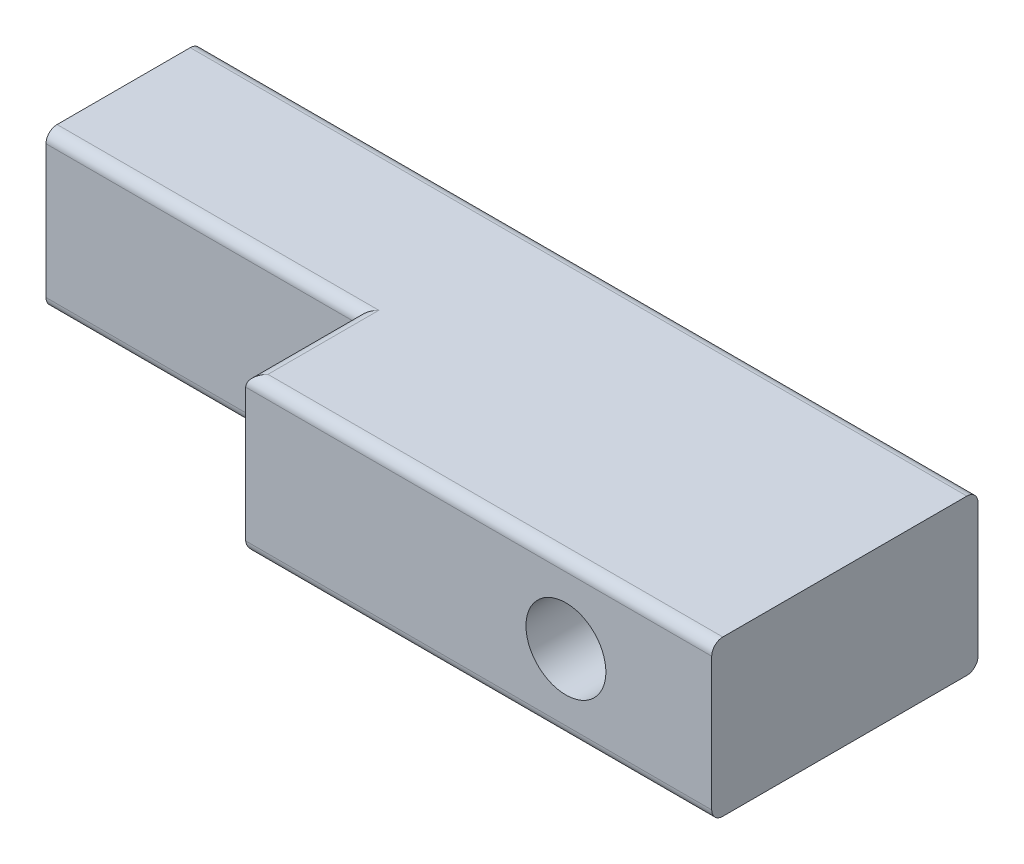
ISO-10303-21;
HEADER;
FILE_DESCRIPTION(('STEP AP214'),'2;1');
FILE_NAME('part.step','',(''),(''),'','','');
FILE_SCHEMA(('AUTOMOTIVE_DESIGN { 1 0 10303 214 1 1 1 1 }'));
ENDSEC;
DATA;
#1=APPLICATION_CONTEXT('core data for automotive mechanical design processes');
#2=APPLICATION_PROTOCOL_DEFINITION('international standard','automotive_design',2000,#1);
#3=PRODUCT_CONTEXT('',#1,'mechanical');
#4=PRODUCT('Part','Part','',(#3));
#5=PRODUCT_RELATED_PRODUCT_CATEGORY('part','',(#4));
#6=PRODUCT_DEFINITION_FORMATION('','',#4);
#7=PRODUCT_DEFINITION_CONTEXT('part definition',#1,'design');
#8=PRODUCT_DEFINITION('design','',#6,#7);
#9=PRODUCT_DEFINITION_SHAPE('','',#8);
#10=(LENGTH_UNIT() NAMED_UNIT(*) SI_UNIT(.MILLI.,.METRE.));
#11=(NAMED_UNIT(*) PLANE_ANGLE_UNIT() SI_UNIT($,.RADIAN.));
#12=(NAMED_UNIT(*) SI_UNIT($,.STERADIAN.) SOLID_ANGLE_UNIT());
#13=UNCERTAINTY_MEASURE_WITH_UNIT(LENGTH_MEASURE(1.E-05),#10,'distance_accuracy_value','');
#14=(GEOMETRIC_REPRESENTATION_CONTEXT(3) GLOBAL_UNCERTAINTY_ASSIGNED_CONTEXT((#13)) GLOBAL_UNIT_ASSIGNED_CONTEXT((#10,
#11,#12)) REPRESENTATION_CONTEXT('',''));
#15=CARTESIAN_POINT('',(0.,0.,0.));
#16=DIRECTION('',(0.,0.,1.));
#17=DIRECTION('',(1.,0.,0.));
#18=AXIS2_PLACEMENT_3D('',#15,#16,#17);
#19=CARTESIAN_POINT('',(0.,0.,7.));
#20=DIRECTION('',(0.,0.,-1.));
#21=DIRECTION('',(-1.,0.,0.));
#22=AXIS2_PLACEMENT_3D('',#19,#20,#21);
#23=PLANE('',#22);
#24=DIRECTION('',(0.,-1.,0.));
#25=VECTOR('',#24,1.);
#26=CARTESIAN_POINT('',(-17.5,-3.5,7.));
#27=LINE('',#26,#25);
#28=CARTESIAN_POINT('',(-17.5,3.,7.));
#29=VERTEX_POINT('',#28);
#30=CARTESIAN_POINT('',(-17.5,-3.,7.));
#31=VERTEX_POINT('',#30);
#32=EDGE_CURVE('E180',#29,#31,#27,.T.);
#33=ORIENTED_EDGE('',*,*,#32,.T.);
#34=DIRECTION('',(1.,0.,0.));
#35=VECTOR('',#34,1.);
#36=CARTESIAN_POINT('',(0.,-3.,7.));
#37=LINE('',#36,#35);
#38=CARTESIAN_POINT('',(-3.5,-3.,7.));
#39=VERTEX_POINT('',#38);
#40=EDGE_CURVE('E153',#31,#39,#37,.T.);
#41=ORIENTED_EDGE('',*,*,#40,.T.);
#42=DIRECTION('',(0.,-1.,0.));
#43=VECTOR('',#42,1.);
#44=CARTESIAN_POINT('',(-3.5,3.5,7.));
#45=LINE('',#44,#43);
#46=CARTESIAN_POINT('',(-3.5,3.,7.));
#47=VERTEX_POINT('',#46);
#48=EDGE_CURVE('E160',#47,#39,#45,.T.);
#49=ORIENTED_EDGE('',*,*,#48,.F.);
#50=DIRECTION('',(-1.,0.,0.));
#51=VECTOR('',#50,1.);
#52=CARTESIAN_POINT('',(0.,3.,7.));
#53=LINE('',#52,#51);
#54=EDGE_CURVE('E145',#47,#29,#53,.T.);
#55=ORIENTED_EDGE('',*,*,#54,.T.);
#56=EDGE_LOOP('',(#33,#41,#49,#55));
#57=FACE_BOUND('',#56,.T.);
#58=ADVANCED_FACE('F40',(#57),#23,.F.);
#59=CARTESIAN_POINT('',(17.5,-3.5,7.));
#60=DIRECTION('',(-1.,0.,0.));
#61=DIRECTION('',(0.,0.,1.));
#62=AXIS2_PLACEMENT_3D('',#59,#60,#61);
#63=PLANE('',#62);
#64=DIRECTION('',(0.,1.,0.));
#65=VECTOR('',#64,1.);
#66=CARTESIAN_POINT('',(17.5,3.5,12.));
#67=LINE('',#66,#65);
#68=CARTESIAN_POINT('',(17.5,-3.,12.));
#69=VERTEX_POINT('',#68);
#70=CARTESIAN_POINT('',(17.5,3.,12.));
#71=VERTEX_POINT('',#70);
#72=EDGE_CURVE('E171',#69,#71,#67,.T.);
#73=ORIENTED_EDGE('',*,*,#72,.F.);
#74=CARTESIAN_POINT('',(17.5,-3.,11.5));
#75=DIRECTION('',(-1.,0.,0.));
#76=DIRECTION('',(0.,0.,1.));
#77=AXIS2_PLACEMENT_3D('',#74,#75,#76);
#78=CIRCLE('',#77,0.5);
#79=CARTESIAN_POINT('',(17.5,-3.5,11.5));
#80=VERTEX_POINT('',#79);
#81=EDGE_CURVE('E258',#69,#80,#78,.F.);
#82=ORIENTED_EDGE('',*,*,#81,.T.);
#83=DIRECTION('',(0.,0.,-1.));
#84=VECTOR('',#83,1.);
#85=CARTESIAN_POINT('',(17.5,-3.5,7.));
#86=LINE('',#85,#84);
#87=CARTESIAN_POINT('',(17.5,-3.5,0.5));
#88=VERTEX_POINT('',#87);
#89=EDGE_CURVE('E183',#80,#88,#86,.T.);
#90=ORIENTED_EDGE('',*,*,#89,.T.);
#91=CARTESIAN_POINT('',(17.5,-3.,0.5));
#92=DIRECTION('',(-1.,0.,0.));
#93=DIRECTION('',(0.,0.,1.));
#94=AXIS2_PLACEMENT_3D('',#91,#92,#93);
#95=CIRCLE('',#94,0.5);
#96=CARTESIAN_POINT('',(17.5,-3.,0.));
#97=VERTEX_POINT('',#96);
#98=EDGE_CURVE('E64',#88,#97,#95,.F.);
#99=ORIENTED_EDGE('',*,*,#98,.T.);
#100=DIRECTION('',(0.,1.,0.));
#101=VECTOR('',#100,1.);
#102=CARTESIAN_POINT('',(17.5,-3.5,0.));
#103=LINE('',#102,#101);
#104=CARTESIAN_POINT('',(17.5,3.,0.));
#105=VERTEX_POINT('',#104);
#106=EDGE_CURVE('E185',#97,#105,#103,.T.);
#107=ORIENTED_EDGE('',*,*,#106,.T.);
#108=CARTESIAN_POINT('',(17.5,3.,0.5));
#109=DIRECTION('',(-1.,0.,0.));
#110=DIRECTION('',(0.,0.,1.));
#111=AXIS2_PLACEMENT_3D('',#108,#109,#110);
#112=CIRCLE('',#111,0.5);
#113=CARTESIAN_POINT('',(17.5,3.5,0.5));
#114=VERTEX_POINT('',#113);
#115=EDGE_CURVE('E250',#105,#114,#112,.F.);
#116=ORIENTED_EDGE('',*,*,#115,.T.);
#117=DIRECTION('',(0.,0.,-1.));
#118=VECTOR('',#117,1.);
#119=CARTESIAN_POINT('',(17.5,3.5,7.));
#120=LINE('',#119,#118);
#121=CARTESIAN_POINT('',(17.5,3.5,11.5));
#122=VERTEX_POINT('',#121);
#123=EDGE_CURVE('E201',#122,#114,#120,.T.);
#124=ORIENTED_EDGE('',*,*,#123,.F.);
#125=CARTESIAN_POINT('',(17.5,3.,11.5));
#126=DIRECTION('',(-1.,0.,0.));
#127=DIRECTION('',(0.,0.,1.));
#128=AXIS2_PLACEMENT_3D('',#125,#126,#127);
#129=CIRCLE('',#128,0.5);
#130=EDGE_CURVE('E255',#122,#71,#129,.F.);
#131=ORIENTED_EDGE('',*,*,#130,.T.);
#132=EDGE_LOOP('',(#73,#82,#90,#99,#107,#116,#124,#131));
#133=FACE_BOUND('',#132,.T.);
#134=ADVANCED_FACE('F309',(#133),#63,.F.);
#135=CARTESIAN_POINT('',(-17.5,3.5,7.));
#136=DIRECTION('',(0.,-1.,0.));
#137=DIRECTION('',(0.,0.,-1.));
#138=AXIS2_PLACEMENT_3D('',#135,#136,#137);
#139=PLANE('',#138);
#140=DIRECTION('',(0.,0.,-1.));
#141=VECTOR('',#140,1.);
#142=CARTESIAN_POINT('',(-17.5,3.5,7.));
#143=LINE('',#142,#141);
#144=CARTESIAN_POINT('',(-17.5,3.5,6.5));
#145=VERTEX_POINT('',#144);
#146=CARTESIAN_POINT('',(-17.5,3.5,0.5));
#147=VERTEX_POINT('',#146);
#148=EDGE_CURVE('E197',#145,#147,#143,.T.);
#149=ORIENTED_EDGE('',*,*,#148,.F.);
#150=DIRECTION('',(-1.,0.,0.));
#151=VECTOR('',#150,1.);
#152=CARTESIAN_POINT('',(-17.5,3.5,6.5));
#153=LINE('',#152,#151);
#154=CARTESIAN_POINT('',(-3.,3.5,6.5));
#155=VERTEX_POINT('',#154);
#156=EDGE_CURVE('E215',#145,#155,#153,.F.);
#157=ORIENTED_EDGE('',*,*,#156,.T.);
#158=DIRECTION('',(0.,0.,-1.));
#159=VECTOR('',#158,1.);
#160=CARTESIAN_POINT('',(-3.,3.5,7.));
#161=LINE('',#160,#159);
#162=CARTESIAN_POINT('',(-3.,3.5,11.5));
#163=VERTEX_POINT('',#162);
#164=EDGE_CURVE('E138',#155,#163,#161,.F.);
#165=ORIENTED_EDGE('',*,*,#164,.T.);
#166=DIRECTION('',(-1.,0.,0.));
#167=VECTOR('',#166,1.);
#168=CARTESIAN_POINT('',(-17.5,3.5,11.5));
#169=LINE('',#168,#167);
#170=EDGE_CURVE('E210',#163,#122,#169,.F.);
#171=ORIENTED_EDGE('',*,*,#170,.T.);
#172=ORIENTED_EDGE('',*,*,#123,.T.);
#173=DIRECTION('',(-1.,0.,0.));
#174=VECTOR('',#173,1.);
#175=CARTESIAN_POINT('',(-17.5,3.5,0.5));
#176=LINE('',#175,#174);
#177=EDGE_CURVE('E166',#114,#147,#176,.T.);
#178=ORIENTED_EDGE('',*,*,#177,.T.);
#179=EDGE_LOOP('',(#149,#157,#165,#171,#172,#178));
#180=FACE_BOUND('',#179,.T.);
#181=ADVANCED_FACE('F304',(#180),#139,.F.);
#182=CARTESIAN_POINT('',(-17.5,-3.5,7.));
#183=DIRECTION('',(1.,0.,0.));
#184=DIRECTION('',(0.,0.,-1.));
#185=AXIS2_PLACEMENT_3D('',#182,#183,#184);
#186=PLANE('',#185);
#187=DIRECTION('',(0.,0.,-1.));
#188=VECTOR('',#187,1.);
#189=CARTESIAN_POINT('',(-17.5,-3.5,7.));
#190=LINE('',#189,#188);
#191=CARTESIAN_POINT('',(-17.5,-3.5,6.5));
#192=VERTEX_POINT('',#191);
#193=CARTESIAN_POINT('',(-17.5,-3.5,0.5));
#194=VERTEX_POINT('',#193);
#195=EDGE_CURVE('E193',#192,#194,#190,.T.);
#196=ORIENTED_EDGE('',*,*,#195,.F.);
#197=CARTESIAN_POINT('',(-17.5,-3.,6.5));
#198=DIRECTION('',(1.,0.,0.));
#199=DIRECTION('',(0.,0.,-1.));
#200=AXIS2_PLACEMENT_3D('',#197,#198,#199);
#201=CIRCLE('',#200,0.5);
#202=EDGE_CURVE('E241',#192,#31,#201,.F.);
#203=ORIENTED_EDGE('',*,*,#202,.T.);
#204=ORIENTED_EDGE('',*,*,#32,.F.);
#205=CARTESIAN_POINT('',(-17.5,3.,6.5));
#206=DIRECTION('',(1.,0.,0.));
#207=DIRECTION('',(0.,0.,-1.));
#208=AXIS2_PLACEMENT_3D('',#205,#206,#207);
#209=CIRCLE('',#208,0.5);
#210=EDGE_CURVE('E147',#29,#145,#209,.F.);
#211=ORIENTED_EDGE('',*,*,#210,.T.);
#212=ORIENTED_EDGE('',*,*,#148,.T.);
#213=CARTESIAN_POINT('',(-17.5,3.,0.5));
#214=DIRECTION('',(1.,0.,0.));
#215=DIRECTION('',(0.,0.,-1.));
#216=AXIS2_PLACEMENT_3D('',#213,#214,#215);
#217=CIRCLE('',#216,0.5);
#218=CARTESIAN_POINT('',(-17.5,3.,0.));
#219=VERTEX_POINT('',#218);
#220=EDGE_CURVE('E233',#147,#219,#217,.F.);
#221=ORIENTED_EDGE('',*,*,#220,.T.);
#222=DIRECTION('',(0.,-1.,0.));
#223=VECTOR('',#222,1.);
#224=CARTESIAN_POINT('',(-17.5,-3.5,0.));
#225=LINE('',#224,#223);
#226=CARTESIAN_POINT('',(-17.5,-3.,0.));
#227=VERTEX_POINT('',#226);
#228=EDGE_CURVE('E184',#219,#227,#225,.T.);
#229=ORIENTED_EDGE('',*,*,#228,.T.);
#230=CARTESIAN_POINT('',(-17.5,-3.,0.5));
#231=DIRECTION('',(1.,0.,0.));
#232=DIRECTION('',(0.,0.,-1.));
#233=AXIS2_PLACEMENT_3D('',#230,#231,#232);
#234=CIRCLE('',#233,0.5);
#235=EDGE_CURVE('E236',#227,#194,#234,.F.);
#236=ORIENTED_EDGE('',*,*,#235,.T.);
#237=EDGE_LOOP('',(#196,#203,#204,#211,#212,#221,#229,#236));
#238=FACE_BOUND('',#237,.T.);
#239=ADVANCED_FACE('F296',(#238),#186,.F.);
#240=CARTESIAN_POINT('',(-17.5,-3.5,7.));
#241=DIRECTION('',(0.,1.,0.));
#242=DIRECTION('',(0.,0.,1.));
#243=AXIS2_PLACEMENT_3D('',#240,#241,#242);
#244=PLANE('',#243);
#245=DIRECTION('',(0.,0.,-1.));
#246=VECTOR('',#245,1.);
#247=CARTESIAN_POINT('',(-3.,-3.5,7.));
#248=LINE('',#247,#246);
#249=CARTESIAN_POINT('',(-3.,-3.5,11.5));
#250=VERTEX_POINT('',#249);
#251=CARTESIAN_POINT('',(-3.,-3.5,6.5));
#252=VERTEX_POINT('',#251);
#253=EDGE_CURVE('E225',#250,#252,#248,.T.);
#254=ORIENTED_EDGE('',*,*,#253,.T.);
#255=DIRECTION('',(1.,0.,0.));
#256=VECTOR('',#255,1.);
#257=CARTESIAN_POINT('',(-17.5,-3.5,6.5));
#258=LINE('',#257,#256);
#259=EDGE_CURVE('E154',#252,#192,#258,.F.);
#260=ORIENTED_EDGE('',*,*,#259,.T.);
#261=ORIENTED_EDGE('',*,*,#195,.T.);
#262=DIRECTION('',(1.,0.,0.));
#263=VECTOR('',#262,1.);
#264=CARTESIAN_POINT('',(17.5,-3.5,0.5));
#265=LINE('',#264,#263);
#266=EDGE_CURVE('E218',#194,#88,#265,.T.);
#267=ORIENTED_EDGE('',*,*,#266,.T.);
#268=ORIENTED_EDGE('',*,*,#89,.F.);
#269=DIRECTION('',(1.,0.,0.));
#270=VECTOR('',#269,1.);
#271=CARTESIAN_POINT('',(-17.5,-3.5,11.5));
#272=LINE('',#271,#270);
#273=EDGE_CURVE('E222',#80,#250,#272,.F.);
#274=ORIENTED_EDGE('',*,*,#273,.T.);
#275=EDGE_LOOP('',(#254,#260,#261,#267,#268,#274));
#276=FACE_BOUND('',#275,.T.);
#277=ADVANCED_FACE('F286',(#276),#244,.F.);
#278=CARTESIAN_POINT('',(0.,0.,0.));
#279=DIRECTION('',(0.,0.,-1.));
#280=DIRECTION('',(-1.,0.,0.));
#281=AXIS2_PLACEMENT_3D('',#278,#279,#280);
#282=PLANE('',#281);
#283=CARTESIAN_POINT('',(10.9295931048964,0.,0.));
#284=DIRECTION('',(0.,0.,-1.));
#285=DIRECTION('',(-1.,0.,0.));
#286=AXIS2_PLACEMENT_3D('',#283,#284,#285);
#287=CIRCLE('',#286,1.8);
#288=CARTESIAN_POINT('',(9.12959310489643,0.,0.));
#289=VERTEX_POINT('',#288);
#290=EDGE_CURVE('E273',#289,#289,#287,.T.);
#291=ORIENTED_EDGE('',*,*,#290,.F.);
#292=EDGE_LOOP('',(#291));
#293=FACE_BOUND('',#292,.T.);
#294=ORIENTED_EDGE('',*,*,#106,.F.);
#295=DIRECTION('',(1.,0.,0.));
#296=VECTOR('',#295,1.);
#297=CARTESIAN_POINT('',(-17.5,-3.,0.));
#298=LINE('',#297,#296);
#299=EDGE_CURVE('E11',#97,#227,#298,.F.);
#300=ORIENTED_EDGE('',*,*,#299,.T.);
#301=ORIENTED_EDGE('',*,*,#228,.F.);
#302=DIRECTION('',(-1.,0.,0.));
#303=VECTOR('',#302,1.);
#304=CARTESIAN_POINT('',(17.5,3.,0.));
#305=LINE('',#304,#303);
#306=EDGE_CURVE('E50',#219,#105,#305,.F.);
#307=ORIENTED_EDGE('',*,*,#306,.T.);
#308=EDGE_LOOP('',(#294,#300,#301,#307));
#309=FACE_BOUND('',#308,.T.);
#310=ADVANCED_FACE('F284',(#293,#309),#282,.T.);
#311=CARTESIAN_POINT('',(-3.5,3.5,12.));
#312=DIRECTION('',(1.,0.,0.));
#313=DIRECTION('',(0.,0.,-1.));
#314=AXIS2_PLACEMENT_3D('',#311,#312,#313);
#315=PLANE('',#314);
#316=DIRECTION('',(0.,-1.,0.));
#317=VECTOR('',#316,1.);
#318=CARTESIAN_POINT('',(-3.5,3.5,12.));
#319=LINE('',#318,#317);
#320=CARTESIAN_POINT('',(-3.5,3.,12.));
#321=VERTEX_POINT('',#320);
#322=CARTESIAN_POINT('',(-3.5,-3.,12.));
#323=VERTEX_POINT('',#322);
#324=EDGE_CURVE('E163',#321,#323,#319,.T.);
#325=ORIENTED_EDGE('',*,*,#324,.F.);
#326=DIRECTION('',(0.,0.,-1.));
#327=VECTOR('',#326,1.);
#328=CARTESIAN_POINT('',(-3.5,3.,12.));
#329=LINE('',#328,#327);
#330=EDGE_CURVE('E137',#321,#47,#329,.T.);
#331=ORIENTED_EDGE('',*,*,#330,.T.);
#332=ORIENTED_EDGE('',*,*,#48,.T.);
#333=DIRECTION('',(0.,0.,-1.));
#334=VECTOR('',#333,1.);
#335=CARTESIAN_POINT('',(-3.5,-3.,12.));
#336=LINE('',#335,#334);
#337=EDGE_CURVE('E167',#39,#323,#336,.F.);
#338=ORIENTED_EDGE('',*,*,#337,.T.);
#339=EDGE_LOOP('',(#325,#331,#332,#338));
#340=FACE_BOUND('',#339,.T.);
#341=ADVANCED_FACE('F159',(#340),#315,.F.);
#342=CARTESIAN_POINT('',(0.,0.,12.));
#343=DIRECTION('',(0.,0.,-1.));
#344=DIRECTION('',(-1.,0.,0.));
#345=AXIS2_PLACEMENT_3D('',#342,#343,#344);
#346=PLANE('',#345);
#347=CARTESIAN_POINT('',(10.9295931048964,0.,12.));
#348=DIRECTION('',(0.,0.,-1.));
#349=DIRECTION('',(-1.,0.,0.));
#350=AXIS2_PLACEMENT_3D('',#347,#348,#349);
#351=CIRCLE('',#350,1.8);
#352=CARTESIAN_POINT('',(9.12959310489643,0.,12.));
#353=VERTEX_POINT('',#352);
#354=EDGE_CURVE('E264',#353,#353,#351,.T.);
#355=ORIENTED_EDGE('',*,*,#354,.T.);
#356=EDGE_LOOP('',(#355));
#357=FACE_BOUND('',#356,.T.);
#358=ORIENTED_EDGE('',*,*,#324,.T.);
#359=DIRECTION('',(1.,0.,0.));
#360=VECTOR('',#359,1.);
#361=CARTESIAN_POINT('',(0.,-3.,12.));
#362=LINE('',#361,#360);
#363=EDGE_CURVE('E247',#323,#69,#362,.T.);
#364=ORIENTED_EDGE('',*,*,#363,.T.);
#365=ORIENTED_EDGE('',*,*,#72,.T.);
#366=DIRECTION('',(-1.,0.,0.));
#367=VECTOR('',#366,1.);
#368=CARTESIAN_POINT('',(0.,3.,12.));
#369=LINE('',#368,#367);
#370=EDGE_CURVE('E244',#71,#321,#369,.T.);
#371=ORIENTED_EDGE('',*,*,#370,.T.);
#372=EDGE_LOOP('',(#358,#364,#365,#371));
#373=FACE_BOUND('',#372,.T.);
#374=ADVANCED_FACE('F316',(#357,#373),#346,.F.);
#375=CARTESIAN_POINT('',(0.,3.,11.5));
#376=DIRECTION('',(-1.,0.,0.));
#377=DIRECTION('',(0.,0.,1.));
#378=AXIS2_PLACEMENT_3D('',#375,#376,#377);
#379=CYLINDRICAL_SURFACE('',#378,0.5);
#380=ORIENTED_EDGE('',*,*,#130,.F.);
#381=ORIENTED_EDGE('',*,*,#170,.F.);
#382=CARTESIAN_POINT('',(-3.,3.,11.5));
#383=DIRECTION('',(-0.707106781186547,0.,-0.707106781186547));
#384=DIRECTION('',(-0.707106781186547,0.,0.707106781186547));
#385=AXIS2_PLACEMENT_3D('',#382,#383,#384);
#386=ELLIPSE('',#385,0.707106781186547,0.5);
#387=EDGE_CURVE('E142',#321,#163,#386,.T.);
#388=ORIENTED_EDGE('',*,*,#387,.F.);
#389=ORIENTED_EDGE('',*,*,#370,.F.);
#390=EDGE_LOOP('',(#380,#381,#388,#389));
#391=FACE_BOUND('',#390,.T.);
#392=ADVANCED_FACE('F314',(#391),#379,.T.);
#393=CARTESIAN_POINT('',(0.,3.,6.5));
#394=DIRECTION('',(-1.,0.,0.));
#395=DIRECTION('',(0.,0.,1.));
#396=AXIS2_PLACEMENT_3D('',#393,#394,#395);
#397=CYLINDRICAL_SURFACE('',#396,0.5);
#398=ORIENTED_EDGE('',*,*,#210,.F.);
#399=ORIENTED_EDGE('',*,*,#54,.F.);
#400=CARTESIAN_POINT('',(-3.,3.,6.5));
#401=DIRECTION('',(-0.707106781186547,0.,-0.707106781186547));
#402=DIRECTION('',(0.707106781186547,0.,-0.707106781186547));
#403=AXIS2_PLACEMENT_3D('',#400,#401,#402);
#404=ELLIPSE('',#403,0.707106781186547,0.5);
#405=EDGE_CURVE('E132',#155,#47,#404,.F.);
#406=ORIENTED_EDGE('',*,*,#405,.F.);
#407=ORIENTED_EDGE('',*,*,#156,.F.);
#408=EDGE_LOOP('',(#398,#399,#406,#407));
#409=FACE_BOUND('',#408,.T.);
#410=ADVANCED_FACE('F146',(#409),#397,.T.);
#411=CARTESIAN_POINT('',(-3.,3.,12.));
#412=DIRECTION('',(0.,0.,-1.));
#413=DIRECTION('',(-1.,0.,0.));
#414=AXIS2_PLACEMENT_3D('',#411,#412,#413);
#415=CYLINDRICAL_SURFACE('',#414,0.5);
#416=ORIENTED_EDGE('',*,*,#387,.T.);
#417=ORIENTED_EDGE('',*,*,#164,.F.);
#418=ORIENTED_EDGE('',*,*,#405,.T.);
#419=ORIENTED_EDGE('',*,*,#330,.F.);
#420=EDGE_LOOP('',(#416,#417,#418,#419));
#421=FACE_BOUND('',#420,.T.);
#422=ADVANCED_FACE('F135',(#421),#415,.T.);
#423=CARTESIAN_POINT('',(0.,-3.,11.5));
#424=DIRECTION('',(1.,0.,0.));
#425=DIRECTION('',(0.,0.,-1.));
#426=AXIS2_PLACEMENT_3D('',#423,#424,#425);
#427=CYLINDRICAL_SURFACE('',#426,0.5);
#428=ORIENTED_EDGE('',*,*,#81,.F.);
#429=ORIENTED_EDGE('',*,*,#363,.F.);
#430=CARTESIAN_POINT('',(-3.,-3.,11.5));
#431=DIRECTION('',(0.707106781186547,0.,0.707106781186547));
#432=DIRECTION('',(0.707106781186547,0.,-0.707106781186547));
#433=AXIS2_PLACEMENT_3D('',#430,#431,#432);
#434=ELLIPSE('',#433,0.707106781186547,0.5);
#435=EDGE_CURVE('E44',#250,#323,#434,.F.);
#436=ORIENTED_EDGE('',*,*,#435,.F.);
#437=ORIENTED_EDGE('',*,*,#273,.F.);
#438=EDGE_LOOP('',(#428,#429,#436,#437));
#439=FACE_BOUND('',#438,.T.);
#440=ADVANCED_FACE('F321',(#439),#427,.T.);
#441=CARTESIAN_POINT('',(0.,-3.,6.5));
#442=DIRECTION('',(1.,0.,0.));
#443=DIRECTION('',(0.,0.,-1.));
#444=AXIS2_PLACEMENT_3D('',#441,#442,#443);
#445=CYLINDRICAL_SURFACE('',#444,0.5);
#446=ORIENTED_EDGE('',*,*,#202,.F.);
#447=ORIENTED_EDGE('',*,*,#259,.F.);
#448=CARTESIAN_POINT('',(-3.,-3.,6.5));
#449=DIRECTION('',(-0.707106781186547,0.,-0.707106781186547));
#450=DIRECTION('',(0.707106781186547,0.,-0.707106781186547));
#451=AXIS2_PLACEMENT_3D('',#448,#449,#450);
#452=ELLIPSE('',#451,0.707106781186547,0.5);
#453=EDGE_CURVE('E262',#39,#252,#452,.F.);
#454=ORIENTED_EDGE('',*,*,#453,.F.);
#455=ORIENTED_EDGE('',*,*,#40,.F.);
#456=EDGE_LOOP('',(#446,#447,#454,#455));
#457=FACE_BOUND('',#456,.T.);
#458=ADVANCED_FACE('F301',(#457),#445,.T.);
#459=CARTESIAN_POINT('',(-3.,-3.,7.));
#460=DIRECTION('',(0.,0.,-1.));
#461=DIRECTION('',(-1.,0.,0.));
#462=AXIS2_PLACEMENT_3D('',#459,#460,#461);
#463=CYLINDRICAL_SURFACE('',#462,0.5);
#464=ORIENTED_EDGE('',*,*,#435,.T.);
#465=ORIENTED_EDGE('',*,*,#337,.F.);
#466=ORIENTED_EDGE('',*,*,#453,.T.);
#467=ORIENTED_EDGE('',*,*,#253,.F.);
#468=EDGE_LOOP('',(#464,#465,#466,#467));
#469=FACE_BOUND('',#468,.T.);
#470=ADVANCED_FACE('F323',(#469),#463,.T.);
#471=CARTESIAN_POINT('',(-17.5,-3.,0.5));
#472=DIRECTION('',(-1.,0.,0.));
#473=DIRECTION('',(0.,0.,1.));
#474=AXIS2_PLACEMENT_3D('',#471,#472,#473);
#475=CYLINDRICAL_SURFACE('',#474,0.5);
#476=ORIENTED_EDGE('',*,*,#235,.F.);
#477=ORIENTED_EDGE('',*,*,#299,.F.);
#478=ORIENTED_EDGE('',*,*,#98,.F.);
#479=ORIENTED_EDGE('',*,*,#266,.F.);
#480=EDGE_LOOP('',(#476,#477,#478,#479));
#481=FACE_BOUND('',#480,.T.);
#482=ADVANCED_FACE('F292',(#481),#475,.T.);
#483=CARTESIAN_POINT('',(-17.5,3.,0.5));
#484=DIRECTION('',(1.,0.,0.));
#485=DIRECTION('',(0.,0.,-1.));
#486=AXIS2_PLACEMENT_3D('',#483,#484,#485);
#487=CYLINDRICAL_SURFACE('',#486,0.5);
#488=ORIENTED_EDGE('',*,*,#115,.F.);
#489=ORIENTED_EDGE('',*,*,#306,.F.);
#490=ORIENTED_EDGE('',*,*,#220,.F.);
#491=ORIENTED_EDGE('',*,*,#177,.F.);
#492=EDGE_LOOP('',(#488,#489,#490,#491));
#493=FACE_BOUND('',#492,.T.);
#494=ADVANCED_FACE('F42',(#493),#487,.T.);
#495=CARTESIAN_POINT('',(10.9295931048964,0.,0.));
#496=DIRECTION('',(0.,0.,-1.));
#497=DIRECTION('',(-1.,0.,0.));
#498=AXIS2_PLACEMENT_3D('',#495,#496,#497);
#499=CYLINDRICAL_SURFACE('',#498,1.8);
#500=ORIENTED_EDGE('',*,*,#354,.F.);
#501=EDGE_LOOP('',(#500));
#502=FACE_BOUND('',#501,.T.);
#503=ORIENTED_EDGE('',*,*,#290,.T.);
#504=EDGE_LOOP('',(#503));
#505=FACE_BOUND('',#504,.T.);
#506=ADVANCED_FACE('F282',(#502,#505),#499,.F.);
#507=CLOSED_SHELL('',(#58,#134,#181,#239,#277,#310,#341,#374,#392,#410,#422,#440,#458,#470,#482,
#494,#506));
#508=MANIFOLD_SOLID_BREP('B2',#507);
#509=ADVANCED_BREP_SHAPE_REPRESENTATION('',(#18,#508),#14);
#510=SHAPE_DEFINITION_REPRESENTATION(#9,#509);
ENDSEC;
END-ISO-10303-21;
